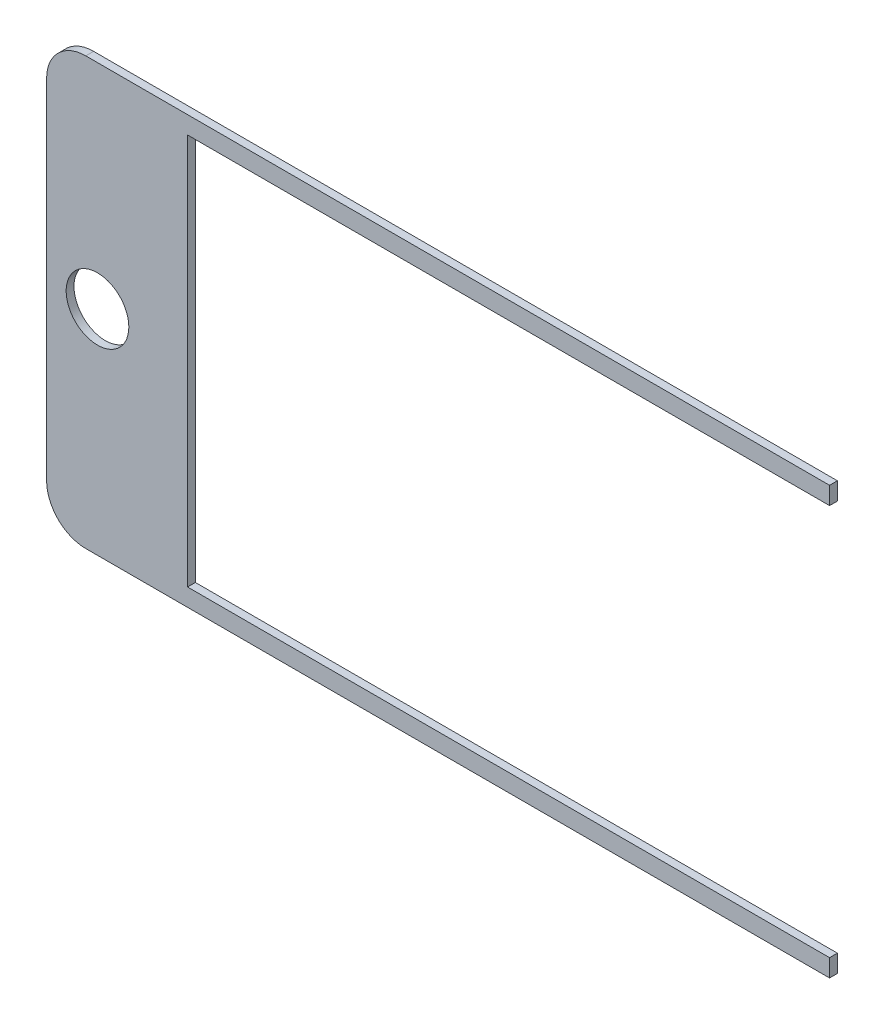
ISO-10303-21;
HEADER;
FILE_DESCRIPTION(('STEP AP214'),'2;1');
FILE_NAME('part.step','',(''),(''),'','','');
FILE_SCHEMA(('AUTOMOTIVE_DESIGN { 1 0 10303 214 1 1 1 1 }'));
ENDSEC;
DATA;
#1=APPLICATION_CONTEXT('core data for automotive mechanical design processes');
#2=APPLICATION_PROTOCOL_DEFINITION('international standard','automotive_design',2000,#1);
#3=PRODUCT_CONTEXT('',#1,'mechanical');
#4=PRODUCT('Part','Part','',(#3));
#5=PRODUCT_RELATED_PRODUCT_CATEGORY('part','',(#4));
#6=PRODUCT_DEFINITION_FORMATION('','',#4);
#7=PRODUCT_DEFINITION_CONTEXT('part definition',#1,'design');
#8=PRODUCT_DEFINITION('design','',#6,#7);
#9=PRODUCT_DEFINITION_SHAPE('','',#8);
#10=(LENGTH_UNIT() NAMED_UNIT(*) SI_UNIT(.MILLI.,.METRE.));
#11=(NAMED_UNIT(*) PLANE_ANGLE_UNIT() SI_UNIT($,.RADIAN.));
#12=(NAMED_UNIT(*) SI_UNIT($,.STERADIAN.) SOLID_ANGLE_UNIT());
#13=UNCERTAINTY_MEASURE_WITH_UNIT(LENGTH_MEASURE(1.E-05),#10,'distance_accuracy_value','');
#14=(GEOMETRIC_REPRESENTATION_CONTEXT(3) GLOBAL_UNCERTAINTY_ASSIGNED_CONTEXT((#13)) GLOBAL_UNIT_ASSIGNED_CONTEXT((#10,
#11,#12)) REPRESENTATION_CONTEXT('',''));
#15=CARTESIAN_POINT('',(0.,0.,0.));
#16=DIRECTION('',(0.,0.,1.));
#17=DIRECTION('',(1.,0.,0.));
#18=AXIS2_PLACEMENT_3D('',#15,#16,#17);
#19=CARTESIAN_POINT('',(100.,54.5,4.49999999999995));
#20=DIRECTION('',(-1.,0.,0.));
#21=DIRECTION('',(0.,-1.,0.));
#22=AXIS2_PLACEMENT_3D('',#19,#20,#21);
#23=PLANE('',#22);
#24=DIRECTION('',(0.,1.,0.));
#25=VECTOR('',#24,1.);
#26=CARTESIAN_POINT('',(100.,54.5,4.49999999999995));
#27=LINE('',#26,#25);
#28=CARTESIAN_POINT('',(100.,50.,4.49999999999995));
#29=VERTEX_POINT('',#28);
#30=CARTESIAN_POINT('',(100.,54.5,4.49999999999995));
#31=VERTEX_POINT('',#30);
#32=EDGE_CURVE('E178',#29,#31,#27,.T.);
#33=ORIENTED_EDGE('',*,*,#32,.F.);
#34=DIRECTION('',(0.,0.,1.));
#35=VECTOR('',#34,1.);
#36=CARTESIAN_POINT('',(100.,50.,2.49999999999995));
#37=LINE('',#36,#35);
#38=CARTESIAN_POINT('',(100.,50.,2.49999999999995));
#39=VERTEX_POINT('',#38);
#40=EDGE_CURVE('E136',#39,#29,#37,.T.);
#41=ORIENTED_EDGE('',*,*,#40,.F.);
#42=DIRECTION('',(0.,1.,0.));
#43=VECTOR('',#42,1.);
#44=CARTESIAN_POINT('',(100.,54.5,2.49999999999995));
#45=LINE('',#44,#43);
#46=CARTESIAN_POINT('',(100.,54.5,2.49999999999995));
#47=VERTEX_POINT('',#46);
#48=EDGE_CURVE('E143',#39,#47,#45,.T.);
#49=ORIENTED_EDGE('',*,*,#48,.T.);
#50=DIRECTION('',(0.,0.,-1.));
#51=VECTOR('',#50,1.);
#52=CARTESIAN_POINT('',(100.,54.5,4.49999999999995));
#53=LINE('',#52,#51);
#54=EDGE_CURVE('E151',#31,#47,#53,.T.);
#55=ORIENTED_EDGE('',*,*,#54,.F.);
#56=EDGE_LOOP('',(#33,#41,#49,#55));
#57=FACE_BOUND('',#56,.T.);
#58=ADVANCED_FACE('F34',(#57),#23,.F.);
#59=CARTESIAN_POINT('',(0.,0.,4.5));
#60=DIRECTION('',(0.,0.,-1.));
#61=DIRECTION('',(-1.,0.,0.));
#62=AXIS2_PLACEMENT_3D('',#59,#60,#61);
#63=PLANE('',#62);
#64=CARTESIAN_POINT('',(-87.0000000000001,0.,4.5));
#65=DIRECTION('',(0.,0.,1.));
#66=DIRECTION('',(1.,0.,0.));
#67=AXIS2_PLACEMENT_3D('',#64,#65,#66);
#68=CIRCLE('',#67,8.00000000000001);
#69=CARTESIAN_POINT('',(-79.0000000000001,0.,4.5));
#70=VERTEX_POINT('',#69);
#71=EDGE_CURVE('E204',#70,#70,#68,.T.);
#72=ORIENTED_EDGE('',*,*,#71,.F.);
#73=EDGE_LOOP('',(#72));
#74=FACE_BOUND('',#73,.T.);
#75=DIRECTION('',(-1.,0.,0.));
#76=VECTOR('',#75,1.);
#77=CARTESIAN_POINT('',(90.0000000000001,50.,4.49999999999995));
#78=LINE('',#77,#76);
#79=CARTESIAN_POINT('',(-64.,50.,4.49999999999995));
#80=VERTEX_POINT('',#79);
#81=EDGE_CURVE('E195',#29,#80,#78,.T.);
#82=ORIENTED_EDGE('',*,*,#81,.F.);
#83=ORIENTED_EDGE('',*,*,#32,.T.);
#84=DIRECTION('',(-1.,0.,0.));
#85=VECTOR('',#84,1.);
#86=CARTESIAN_POINT('',(100.,54.5,4.49999999999995));
#87=LINE('',#86,#85);
#88=CARTESIAN_POINT('',(-90.,54.5,4.5));
#89=VERTEX_POINT('',#88);
#90=EDGE_CURVE('E154',#31,#89,#87,.T.);
#91=ORIENTED_EDGE('',*,*,#90,.T.);
#92=CARTESIAN_POINT('',(-90.0000000000001,44.5,4.5));
#93=DIRECTION('',(0.,0.,-1.));
#94=DIRECTION('',(-1.,0.,0.));
#95=AXIS2_PLACEMENT_3D('',#92,#93,#94);
#96=CIRCLE('',#95,10.);
#97=CARTESIAN_POINT('',(-99.9999999999999,44.5,4.5));
#98=VERTEX_POINT('',#97);
#99=EDGE_CURVE('E167',#89,#98,#96,.F.);
#100=ORIENTED_EDGE('',*,*,#99,.T.);
#101=DIRECTION('',(0.,-1.,0.));
#102=VECTOR('',#101,1.);
#103=CARTESIAN_POINT('',(-99.9999999999999,54.5,4.49999999999995));
#104=LINE('',#103,#102);
#105=CARTESIAN_POINT('',(-99.9999999999999,-44.5,4.49999999999995));
#106=VERTEX_POINT('',#105);
#107=EDGE_CURVE('E145',#98,#106,#104,.T.);
#108=ORIENTED_EDGE('',*,*,#107,.T.);
#109=CARTESIAN_POINT('',(-90.0000000000001,-44.5000000000001,4.49999999999995));
#110=DIRECTION('',(0.,0.,-1.));
#111=DIRECTION('',(-1.,0.,0.));
#112=AXIS2_PLACEMENT_3D('',#109,#110,#111);
#113=CIRCLE('',#112,10.);
#114=CARTESIAN_POINT('',(-90.0000000000001,-54.5,4.49999999999995));
#115=VERTEX_POINT('',#114);
#116=EDGE_CURVE('E43',#106,#115,#113,.F.);
#117=ORIENTED_EDGE('',*,*,#116,.T.);
#118=DIRECTION('',(1.,0.,0.));
#119=VECTOR('',#118,1.);
#120=CARTESIAN_POINT('',(100.,-54.5,4.49999999999995));
#121=LINE('',#120,#119);
#122=CARTESIAN_POINT('',(100.,-54.5,4.49999999999995));
#123=VERTEX_POINT('',#122);
#124=EDGE_CURVE('E173',#115,#123,#121,.T.);
#125=ORIENTED_EDGE('',*,*,#124,.T.);
#126=CARTESIAN_POINT('',(100.,-50.0000000000001,4.5));
#127=VERTEX_POINT('',#126);
#128=EDGE_CURVE('E190',#123,#127,#27,.T.);
#129=ORIENTED_EDGE('',*,*,#128,.T.);
#130=DIRECTION('',(1.,0.,0.));
#131=VECTOR('',#130,1.);
#132=CARTESIAN_POINT('',(90.0000000000001,-50.,4.50000000000006));
#133=LINE('',#132,#131);
#134=CARTESIAN_POINT('',(-64.,-50.,4.5));
#135=VERTEX_POINT('',#134);
#136=EDGE_CURVE('E132',#135,#127,#133,.T.);
#137=ORIENTED_EDGE('',*,*,#136,.F.);
#138=DIRECTION('',(0.,-1.,0.));
#139=VECTOR('',#138,1.);
#140=CARTESIAN_POINT('',(-64.,50.,4.49999999999995));
#141=LINE('',#140,#139);
#142=EDGE_CURVE('E196',#80,#135,#141,.T.);
#143=ORIENTED_EDGE('',*,*,#142,.F.);
#144=EDGE_LOOP('',(#82,#83,#91,#100,#108,#117,#125,#129,#137,#143));
#145=FACE_BOUND('',#144,.T.);
#146=ADVANCED_FACE('F172',(#74,#145),#63,.F.);
#147=CARTESIAN_POINT('',(0.,0.,2.49999999999995));
#148=DIRECTION('',(0.,0.,-1.));
#149=DIRECTION('',(-1.,0.,0.));
#150=AXIS2_PLACEMENT_3D('',#147,#148,#149);
#151=PLANE('',#150);
#152=CARTESIAN_POINT('',(-87.0000000000001,0.,2.49999999999995));
#153=DIRECTION('',(0.,0.,-1.));
#154=DIRECTION('',(-1.,0.,0.));
#155=AXIS2_PLACEMENT_3D('',#152,#153,#154);
#156=CIRCLE('',#155,8.00000000000001);
#157=CARTESIAN_POINT('',(-95.0000000000002,0.,2.49999999999995));
#158=VERTEX_POINT('',#157);
#159=EDGE_CURVE('E38',#158,#158,#156,.T.);
#160=ORIENTED_EDGE('',*,*,#159,.F.);
#161=EDGE_LOOP('',(#160));
#162=FACE_BOUND('',#161,.T.);
#163=ORIENTED_EDGE('',*,*,#48,.F.);
#164=DIRECTION('',(-1.,0.,0.));
#165=VECTOR('',#164,1.);
#166=CARTESIAN_POINT('',(90.,50.,2.5));
#167=LINE('',#166,#165);
#168=CARTESIAN_POINT('',(-64.,50.,2.49999999999989));
#169=VERTEX_POINT('',#168);
#170=EDGE_CURVE('E126',#39,#169,#167,.T.);
#171=ORIENTED_EDGE('',*,*,#170,.T.);
#172=DIRECTION('',(0.,-1.,0.));
#173=VECTOR('',#172,1.);
#174=CARTESIAN_POINT('',(-64.,50.,2.49999999999989));
#175=LINE('',#174,#173);
#176=CARTESIAN_POINT('',(-64.,-50.0000000000001,2.5));
#177=VERTEX_POINT('',#176);
#178=EDGE_CURVE('E122',#169,#177,#175,.T.);
#179=ORIENTED_EDGE('',*,*,#178,.T.);
#180=DIRECTION('',(1.,0.,0.));
#181=VECTOR('',#180,1.);
#182=CARTESIAN_POINT('',(90.0000000000001,-50.,2.5));
#183=LINE('',#182,#181);
#184=CARTESIAN_POINT('',(100.,-50.,2.50000000000006));
#185=VERTEX_POINT('',#184);
#186=EDGE_CURVE('E114',#177,#185,#183,.T.);
#187=ORIENTED_EDGE('',*,*,#186,.T.);
#188=CARTESIAN_POINT('',(100.,-54.5,2.49999999999995));
#189=VERTEX_POINT('',#188);
#190=EDGE_CURVE('E120',#189,#185,#45,.T.);
#191=ORIENTED_EDGE('',*,*,#190,.F.);
#192=DIRECTION('',(1.,0.,0.));
#193=VECTOR('',#192,1.);
#194=CARTESIAN_POINT('',(100.,-54.5,2.49999999999995));
#195=LINE('',#194,#193);
#196=CARTESIAN_POINT('',(-90.0000000000001,-54.5,2.49999999999995));
#197=VERTEX_POINT('',#196);
#198=EDGE_CURVE('E147',#197,#189,#195,.T.);
#199=ORIENTED_EDGE('',*,*,#198,.F.);
#200=CARTESIAN_POINT('',(-90.,-44.5,2.5));
#201=DIRECTION('',(0.,0.,-1.));
#202=DIRECTION('',(-1.,0.,0.));
#203=AXIS2_PLACEMENT_3D('',#200,#201,#202);
#204=CIRCLE('',#203,10.);
#205=CARTESIAN_POINT('',(-100.,-44.5,2.5));
#206=VERTEX_POINT('',#205);
#207=EDGE_CURVE('E161',#197,#206,#204,.T.);
#208=ORIENTED_EDGE('',*,*,#207,.T.);
#209=DIRECTION('',(0.,-1.,0.));
#210=VECTOR('',#209,1.);
#211=CARTESIAN_POINT('',(-100.,54.4999999999999,2.5));
#212=LINE('',#211,#210);
#213=CARTESIAN_POINT('',(-100.,44.4999999999999,2.50000000000006));
#214=VERTEX_POINT('',#213);
#215=EDGE_CURVE('E182',#214,#206,#212,.T.);
#216=ORIENTED_EDGE('',*,*,#215,.F.);
#217=CARTESIAN_POINT('',(-89.9999999999999,44.4999999999999,2.49999999999984));
#218=DIRECTION('',(0.,0.,-1.));
#219=DIRECTION('',(-1.,0.,0.));
#220=AXIS2_PLACEMENT_3D('',#217,#218,#219);
#221=CIRCLE('',#220,10.);
#222=CARTESIAN_POINT('',(-90.,54.4999999999999,2.5));
#223=VERTEX_POINT('',#222);
#224=EDGE_CURVE('E159',#214,#223,#221,.T.);
#225=ORIENTED_EDGE('',*,*,#224,.T.);
#226=DIRECTION('',(-1.,0.,0.));
#227=VECTOR('',#226,1.);
#228=CARTESIAN_POINT('',(100.,54.5,2.49999999999995));
#229=LINE('',#228,#227);
#230=EDGE_CURVE('E142',#47,#223,#229,.T.);
#231=ORIENTED_EDGE('',*,*,#230,.F.);
#232=EDGE_LOOP('',(#163,#171,#179,#187,#191,#199,#208,#216,#225,#231));
#233=FACE_BOUND('',#232,.T.);
#234=ADVANCED_FACE('F117',(#162,#233),#151,.T.);
#235=CARTESIAN_POINT('',(-99.9999999999999,54.5,4.49999999999995));
#236=DIRECTION('',(1.,0.,0.));
#237=DIRECTION('',(0.,0.,-1.));
#238=AXIS2_PLACEMENT_3D('',#235,#236,#237);
#239=PLANE('',#238);
#240=ORIENTED_EDGE('',*,*,#215,.T.);
#241=DIRECTION('',(0.,0.,-1.));
#242=VECTOR('',#241,1.);
#243=CARTESIAN_POINT('',(-99.9999999999999,-44.5,4.49999999999995));
#244=LINE('',#243,#242);
#245=EDGE_CURVE('E56',#206,#106,#244,.F.);
#246=ORIENTED_EDGE('',*,*,#245,.T.);
#247=ORIENTED_EDGE('',*,*,#107,.F.);
#248=DIRECTION('',(0.,0.,-1.));
#249=VECTOR('',#248,1.);
#250=CARTESIAN_POINT('',(-99.9999999999999,44.5,4.5));
#251=LINE('',#250,#249);
#252=EDGE_CURVE('E163',#98,#214,#251,.T.);
#253=ORIENTED_EDGE('',*,*,#252,.T.);
#254=EDGE_LOOP('',(#240,#246,#247,#253));
#255=FACE_BOUND('',#254,.T.);
#256=ADVANCED_FACE('F183',(#255),#239,.F.);
#257=CARTESIAN_POINT('',(100.,-54.5,4.49999999999995));
#258=DIRECTION('',(0.,1.,0.));
#259=DIRECTION('',(-1.,0.,0.));
#260=AXIS2_PLACEMENT_3D('',#257,#258,#259);
#261=PLANE('',#260);
#262=ORIENTED_EDGE('',*,*,#124,.F.);
#263=DIRECTION('',(0.,0.,-1.));
#264=VECTOR('',#263,1.);
#265=CARTESIAN_POINT('',(-90.0000000000001,-54.5,4.49999999999995));
#266=LINE('',#265,#264);
#267=EDGE_CURVE('E156',#115,#197,#266,.T.);
#268=ORIENTED_EDGE('',*,*,#267,.T.);
#269=ORIENTED_EDGE('',*,*,#198,.T.);
#270=DIRECTION('',(0.,0.,-1.));
#271=VECTOR('',#270,1.);
#272=CARTESIAN_POINT('',(100.,-54.5,4.49999999999995));
#273=LINE('',#272,#271);
#274=EDGE_CURVE('E141',#123,#189,#273,.T.);
#275=ORIENTED_EDGE('',*,*,#274,.F.);
#276=EDGE_LOOP('',(#262,#268,#269,#275));
#277=FACE_BOUND('',#276,.T.);
#278=ADVANCED_FACE('F177',(#277),#261,.F.);
#279=ORIENTED_EDGE('',*,*,#190,.T.);
#280=DIRECTION('',(0.,0.,1.));
#281=VECTOR('',#280,1.);
#282=CARTESIAN_POINT('',(100.,-50.,2.50000000000006));
#283=LINE('',#282,#281);
#284=EDGE_CURVE('E129',#185,#127,#283,.T.);
#285=ORIENTED_EDGE('',*,*,#284,.T.);
#286=ORIENTED_EDGE('',*,*,#128,.F.);
#287=ORIENTED_EDGE('',*,*,#274,.T.);
#288=EDGE_LOOP('',(#279,#285,#286,#287));
#289=FACE_BOUND('',#288,.T.);
#290=ADVANCED_FACE('F139',(#289),#23,.F.);
#291=CARTESIAN_POINT('',(100.,54.5,4.49999999999995));
#292=DIRECTION('',(0.,-1.,0.));
#293=DIRECTION('',(1.,0.,0.));
#294=AXIS2_PLACEMENT_3D('',#291,#292,#293);
#295=PLANE('',#294);
#296=ORIENTED_EDGE('',*,*,#230,.T.);
#297=DIRECTION('',(0.,0.,-1.));
#298=VECTOR('',#297,1.);
#299=CARTESIAN_POINT('',(-90.,54.5,4.5));
#300=LINE('',#299,#298);
#301=EDGE_CURVE('E11',#223,#89,#300,.F.);
#302=ORIENTED_EDGE('',*,*,#301,.T.);
#303=ORIENTED_EDGE('',*,*,#90,.F.);
#304=ORIENTED_EDGE('',*,*,#54,.T.);
#305=EDGE_LOOP('',(#296,#302,#303,#304));
#306=FACE_BOUND('',#305,.T.);
#307=ADVANCED_FACE('F231',(#306),#295,.F.);
#308=CARTESIAN_POINT('',(-64.,50.,4.49999999999995));
#309=DIRECTION('',(1.,0.,0.));
#310=DIRECTION('',(0.,1.,0.));
#311=AXIS2_PLACEMENT_3D('',#308,#309,#310);
#312=PLANE('',#311);
#313=ORIENTED_EDGE('',*,*,#178,.F.);
#314=DIRECTION('',(0.,0.,-1.));
#315=VECTOR('',#314,1.);
#316=CARTESIAN_POINT('',(-64.,50.,4.49999999999995));
#317=LINE('',#316,#315);
#318=EDGE_CURVE('E186',#80,#169,#317,.T.);
#319=ORIENTED_EDGE('',*,*,#318,.F.);
#320=ORIENTED_EDGE('',*,*,#142,.T.);
#321=DIRECTION('',(0.,0.,-1.));
#322=VECTOR('',#321,1.);
#323=CARTESIAN_POINT('',(-64.,-50.,4.5));
#324=LINE('',#323,#322);
#325=EDGE_CURVE('E185',#135,#177,#324,.T.);
#326=ORIENTED_EDGE('',*,*,#325,.T.);
#327=EDGE_LOOP('',(#313,#319,#320,#326));
#328=FACE_BOUND('',#327,.T.);
#329=ADVANCED_FACE('F236',(#328),#312,.T.);
#330=CARTESIAN_POINT('',(90.0000000000001,-50.,4.50000000000006));
#331=DIRECTION('',(0.,1.,0.));
#332=DIRECTION('',(-1.,0.,0.));
#333=AXIS2_PLACEMENT_3D('',#330,#331,#332);
#334=PLANE('',#333);
#335=ORIENTED_EDGE('',*,*,#186,.F.);
#336=ORIENTED_EDGE('',*,*,#325,.F.);
#337=ORIENTED_EDGE('',*,*,#136,.T.);
#338=ORIENTED_EDGE('',*,*,#284,.F.);
#339=EDGE_LOOP('',(#335,#336,#337,#338));
#340=FACE_BOUND('',#339,.T.);
#341=ADVANCED_FACE('F130',(#340),#334,.T.);
#342=CARTESIAN_POINT('',(90.0000000000001,50.,4.49999999999995));
#343=DIRECTION('',(0.,-1.,0.));
#344=DIRECTION('',(1.,0.,0.));
#345=AXIS2_PLACEMENT_3D('',#342,#343,#344);
#346=PLANE('',#345);
#347=ORIENTED_EDGE('',*,*,#170,.F.);
#348=ORIENTED_EDGE('',*,*,#40,.T.);
#349=ORIENTED_EDGE('',*,*,#81,.T.);
#350=ORIENTED_EDGE('',*,*,#318,.T.);
#351=EDGE_LOOP('',(#347,#348,#349,#350));
#352=FACE_BOUND('',#351,.T.);
#353=ADVANCED_FACE('F240',(#352),#346,.T.);
#354=CARTESIAN_POINT('',(-90.0000000000001,-44.5000000000001,4.49999999999995));
#355=DIRECTION('',(0.,0.,-1.));
#356=DIRECTION('',(-1.,0.,0.));
#357=AXIS2_PLACEMENT_3D('',#354,#355,#356);
#358=CYLINDRICAL_SURFACE('',#357,10.);
#359=ORIENTED_EDGE('',*,*,#116,.F.);
#360=ORIENTED_EDGE('',*,*,#245,.F.);
#361=ORIENTED_EDGE('',*,*,#207,.F.);
#362=ORIENTED_EDGE('',*,*,#267,.F.);
#363=EDGE_LOOP('',(#359,#360,#361,#362));
#364=FACE_BOUND('',#363,.T.);
#365=ADVANCED_FACE('F180',(#364),#358,.T.);
#366=CARTESIAN_POINT('',(-90.0000000000001,44.5,4.5));
#367=DIRECTION('',(0.,0.,-1.));
#368=DIRECTION('',(-1.,0.,0.));
#369=AXIS2_PLACEMENT_3D('',#366,#367,#368);
#370=CYLINDRICAL_SURFACE('',#369,10.);
#371=ORIENTED_EDGE('',*,*,#99,.F.);
#372=ORIENTED_EDGE('',*,*,#301,.F.);
#373=ORIENTED_EDGE('',*,*,#224,.F.);
#374=ORIENTED_EDGE('',*,*,#252,.F.);
#375=EDGE_LOOP('',(#371,#372,#373,#374));
#376=FACE_BOUND('',#375,.T.);
#377=ADVANCED_FACE('F36',(#376),#370,.T.);
#378=CARTESIAN_POINT('',(-87.,0.,0.));
#379=DIRECTION('',(0.,0.,1.));
#380=DIRECTION('',(1.,0.,0.));
#381=AXIS2_PLACEMENT_3D('',#378,#379,#380);
#382=CYLINDRICAL_SURFACE('',#381,8.00000000000001);
#383=ORIENTED_EDGE('',*,*,#159,.T.);
#384=EDGE_LOOP('',(#383));
#385=FACE_BOUND('',#384,.T.);
#386=ORIENTED_EDGE('',*,*,#71,.T.);
#387=EDGE_LOOP('',(#386));
#388=FACE_BOUND('',#387,.T.);
#389=ADVANCED_FACE('F211',(#385,#388),#382,.F.);
#390=CLOSED_SHELL('',(#58,#146,#234,#256,#278,#290,#307,#329,#341,#353,#365,#377,#389));
#391=MANIFOLD_SOLID_BREP('B2',#390);
#392=ADVANCED_BREP_SHAPE_REPRESENTATION('',(#18,#391),#14);
#393=SHAPE_DEFINITION_REPRESENTATION(#9,#392);
ENDSEC;
END-ISO-10303-21;
